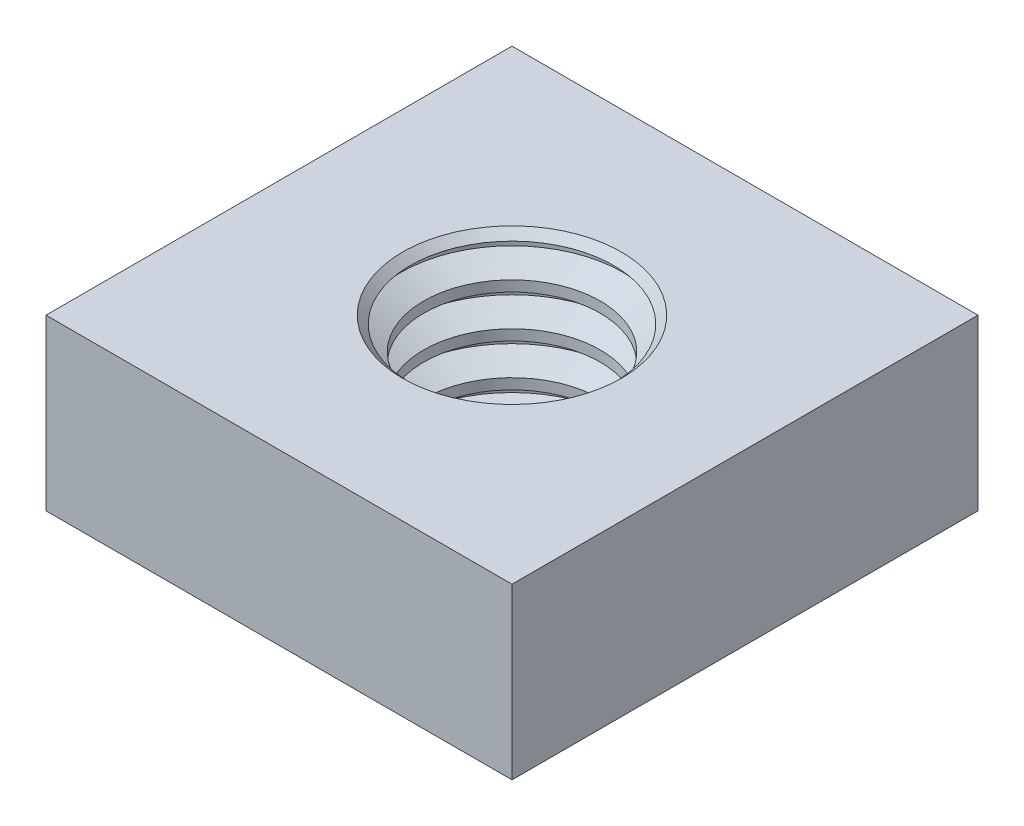
ISO-10303-21;
HEADER;
FILE_DESCRIPTION(('STEP AP214'),'2;1');
FILE_NAME('part.step','',(''),(''),'','','');
FILE_SCHEMA(('AUTOMOTIVE_DESIGN { 1 0 10303 214 1 1 1 1 }'));
ENDSEC;
DATA;
#1=APPLICATION_CONTEXT('core data for automotive mechanical design processes');
#2=APPLICATION_PROTOCOL_DEFINITION('international standard','automotive_design',2000,#1);
#3=PRODUCT_CONTEXT('',#1,'mechanical');
#4=PRODUCT('Part','Part','',(#3));
#5=PRODUCT_RELATED_PRODUCT_CATEGORY('part','',(#4));
#6=PRODUCT_DEFINITION_FORMATION('','',#4);
#7=PRODUCT_DEFINITION_CONTEXT('part definition',#1,'design');
#8=PRODUCT_DEFINITION('design','',#6,#7);
#9=PRODUCT_DEFINITION_SHAPE('','',#8);
#10=(LENGTH_UNIT() NAMED_UNIT(*) SI_UNIT(.MILLI.,.METRE.));
#11=(NAMED_UNIT(*) PLANE_ANGLE_UNIT() SI_UNIT($,.RADIAN.));
#12=(NAMED_UNIT(*) SI_UNIT($,.STERADIAN.) SOLID_ANGLE_UNIT());
#13=UNCERTAINTY_MEASURE_WITH_UNIT(LENGTH_MEASURE(1.E-05),#10,'distance_accuracy_value','');
#14=(GEOMETRIC_REPRESENTATION_CONTEXT(3) GLOBAL_UNCERTAINTY_ASSIGNED_CONTEXT((#13)) GLOBAL_UNIT_ASSIGNED_CONTEXT((#10,
#11,#12)) REPRESENTATION_CONTEXT('',''));
#15=CARTESIAN_POINT('',(0.,0.,0.));
#16=DIRECTION('',(0.,0.,1.));
#17=DIRECTION('',(1.,0.,0.));
#18=AXIS2_PLACEMENT_3D('',#15,#16,#17);
#19=CARTESIAN_POINT('',(4.365625,0.,-4.36562499999993));
#20=DIRECTION('',(0.,1.,0.));
#21=DIRECTION('',(0.,0.,1.));
#22=AXIS2_PLACEMENT_3D('',#19,#20,#21);
#23=PLANE('',#22);
#24=DIRECTION('',(-1.,0.,0.));
#25=VECTOR('',#24,1.);
#26=CARTESIAN_POINT('',(-4.365625,0.,-4.36562499999993));
#27=LINE('',#26,#25);
#28=CARTESIAN_POINT('',(4.365625,0.,-4.36562499999993));
#29=VERTEX_POINT('',#28);
#30=CARTESIAN_POINT('',(-4.365625,0.,-4.36562499999993));
#31=VERTEX_POINT('',#30);
#32=EDGE_CURVE('E100',#29,#31,#27,.T.);
#33=ORIENTED_EDGE('',*,*,#32,.F.);
#34=DIRECTION('',(0.,0.,-1.));
#35=VECTOR('',#34,1.);
#36=CARTESIAN_POINT('',(4.365625,0.,4.36562500000007));
#37=LINE('',#36,#35);
#38=CARTESIAN_POINT('',(4.365625,0.,4.36562500000007));
#39=VERTEX_POINT('',#38);
#40=EDGE_CURVE('E72',#39,#29,#37,.T.);
#41=ORIENTED_EDGE('',*,*,#40,.F.);
#42=DIRECTION('',(1.,0.,0.));
#43=VECTOR('',#42,1.);
#44=CARTESIAN_POINT('',(-4.365625,0.,4.36562500000007));
#45=LINE('',#44,#43);
#46=CARTESIAN_POINT('',(-4.365625,0.,4.36562500000007));
#47=VERTEX_POINT('',#46);
#48=EDGE_CURVE('E66',#47,#39,#45,.T.);
#49=ORIENTED_EDGE('',*,*,#48,.F.);
#50=DIRECTION('',(0.,0.,1.));
#51=VECTOR('',#50,1.);
#52=CARTESIAN_POINT('',(-4.365625,0.,-4.36562499999993));
#53=LINE('',#52,#51);
#54=EDGE_CURVE('E90',#31,#47,#53,.T.);
#55=ORIENTED_EDGE('',*,*,#54,.F.);
#56=EDGE_LOOP('',(#33,#41,#49,#55));
#57=FACE_BOUND('',#56,.T.);
#58=CARTESIAN_POINT('',(0.,0.,0.));
#59=DIRECTION('',(0.,1.,0.));
#60=DIRECTION('',(0.,0.,1.));
#61=AXIS2_PLACEMENT_3D('',#58,#59,#60);
#62=CIRCLE('',#61,1.65317020984131);
#63=CARTESIAN_POINT('',(0.,0.,1.65317020984131));
#64=VERTEX_POINT('',#63);
#65=EDGE_CURVE('E193',#64,#64,#62,.T.);
#66=ORIENTED_EDGE('',*,*,#65,.T.);
#67=EDGE_LOOP('',(#66));
#68=FACE_BOUND('',#67,.T.);
#69=ADVANCED_FACE('F32',(#57,#68),#23,.F.);
#70=CARTESIAN_POINT('',(4.365625,3.175,-4.36562499999993));
#71=DIRECTION('',(0.,1.,0.));
#72=DIRECTION('',(0.,0.,1.));
#73=AXIS2_PLACEMENT_3D('',#70,#71,#72);
#74=PLANE('',#73);
#75=CARTESIAN_POINT('',(0.,3.175,0.));
#76=DIRECTION('',(0.,1.,0.));
#77=DIRECTION('',(0.,0.,1.));
#78=AXIS2_PLACEMENT_3D('',#75,#76,#77);
#79=CIRCLE('',#78,2.05004520984131);
#80=CARTESIAN_POINT('',(0.,3.175,2.05004520984131));
#81=VERTEX_POINT('',#80);
#82=EDGE_CURVE('E11',#81,#81,#79,.F.);
#83=ORIENTED_EDGE('',*,*,#82,.T.);
#84=EDGE_LOOP('',(#83));
#85=FACE_BOUND('',#84,.T.);
#86=DIRECTION('',(-1.,0.,0.));
#87=VECTOR('',#86,1.);
#88=CARTESIAN_POINT('',(-4.365625,3.175,-4.36562499999993));
#89=LINE('',#88,#87);
#90=CARTESIAN_POINT('',(4.365625,3.175,-4.36562499999993));
#91=VERTEX_POINT('',#90);
#92=CARTESIAN_POINT('',(-4.365625,3.175,-4.36562499999993));
#93=VERTEX_POINT('',#92);
#94=EDGE_CURVE('E85',#91,#93,#89,.T.);
#95=ORIENTED_EDGE('',*,*,#94,.T.);
#96=DIRECTION('',(0.,0.,1.));
#97=VECTOR('',#96,1.);
#98=CARTESIAN_POINT('',(-4.365625,3.175,-4.36562499999993));
#99=LINE('',#98,#97);
#100=CARTESIAN_POINT('',(-4.365625,3.175,4.36562500000007));
#101=VERTEX_POINT('',#100);
#102=EDGE_CURVE('E80',#93,#101,#99,.T.);
#103=ORIENTED_EDGE('',*,*,#102,.T.);
#104=DIRECTION('',(1.,0.,0.));
#105=VECTOR('',#104,1.);
#106=CARTESIAN_POINT('',(-4.365625,3.175,4.36562500000007));
#107=LINE('',#106,#105);
#108=CARTESIAN_POINT('',(4.365625,3.175,4.36562500000007));
#109=VERTEX_POINT('',#108);
#110=EDGE_CURVE('E83',#101,#109,#107,.T.);
#111=ORIENTED_EDGE('',*,*,#110,.T.);
#112=DIRECTION('',(0.,0.,-1.));
#113=VECTOR('',#112,1.);
#114=CARTESIAN_POINT('',(4.365625,3.175,4.36562500000007));
#115=LINE('',#114,#113);
#116=EDGE_CURVE('E49',#109,#91,#115,.T.);
#117=ORIENTED_EDGE('',*,*,#116,.T.);
#118=EDGE_LOOP('',(#95,#103,#111,#117));
#119=FACE_BOUND('',#118,.T.);
#120=ADVANCED_FACE('F81',(#85,#119),#74,.T.);
#121=CARTESIAN_POINT('',(-4.365625,3.175,-4.36562499999993));
#122=DIRECTION('',(0.,0.,1.));
#123=DIRECTION('',(1.,0.,0.));
#124=AXIS2_PLACEMENT_3D('',#121,#122,#123);
#125=PLANE('',#124);
#126=ORIENTED_EDGE('',*,*,#32,.T.);
#127=DIRECTION('',(0.,-1.,0.));
#128=VECTOR('',#127,1.);
#129=CARTESIAN_POINT('',(-4.365625,3.175,-4.36562499999993));
#130=LINE('',#129,#128);
#131=EDGE_CURVE('E91',#93,#31,#130,.T.);
#132=ORIENTED_EDGE('',*,*,#131,.F.);
#133=ORIENTED_EDGE('',*,*,#94,.F.);
#134=DIRECTION('',(0.,-1.,0.));
#135=VECTOR('',#134,1.);
#136=CARTESIAN_POINT('',(4.365625,3.175,-4.36562499999993));
#137=LINE('',#136,#135);
#138=EDGE_CURVE('E96',#91,#29,#137,.T.);
#139=ORIENTED_EDGE('',*,*,#138,.T.);
#140=EDGE_LOOP('',(#126,#132,#133,#139));
#141=FACE_BOUND('',#140,.T.);
#142=ADVANCED_FACE('F131',(#141),#125,.F.);
#143=CARTESIAN_POINT('',(-4.365625,3.175,-4.36562499999993));
#144=DIRECTION('',(1.,0.,0.));
#145=DIRECTION('',(0.,0.,-1.));
#146=AXIS2_PLACEMENT_3D('',#143,#144,#145);
#147=PLANE('',#146);
#148=ORIENTED_EDGE('',*,*,#54,.T.);
#149=DIRECTION('',(0.,-1.,0.));
#150=VECTOR('',#149,1.);
#151=CARTESIAN_POINT('',(-4.365625,3.175,4.36562500000007));
#152=LINE('',#151,#150);
#153=EDGE_CURVE('E88',#101,#47,#152,.T.);
#154=ORIENTED_EDGE('',*,*,#153,.F.);
#155=ORIENTED_EDGE('',*,*,#102,.F.);
#156=ORIENTED_EDGE('',*,*,#131,.T.);
#157=EDGE_LOOP('',(#148,#154,#155,#156));
#158=FACE_BOUND('',#157,.T.);
#159=ADVANCED_FACE('F89',(#158),#147,.F.);
#160=CARTESIAN_POINT('',(-4.365625,3.175,4.36562500000007));
#161=DIRECTION('',(0.,0.,-1.));
#162=DIRECTION('',(-1.,0.,0.));
#163=AXIS2_PLACEMENT_3D('',#160,#161,#162);
#164=PLANE('',#163);
#165=ORIENTED_EDGE('',*,*,#48,.T.);
#166=DIRECTION('',(0.,-1.,0.));
#167=VECTOR('',#166,1.);
#168=CARTESIAN_POINT('',(4.365625,3.175,4.36562500000007));
#169=LINE('',#168,#167);
#170=EDGE_CURVE('E92',#109,#39,#169,.T.);
#171=ORIENTED_EDGE('',*,*,#170,.F.);
#172=ORIENTED_EDGE('',*,*,#110,.F.);
#173=ORIENTED_EDGE('',*,*,#153,.T.);
#174=EDGE_LOOP('',(#165,#171,#172,#173));
#175=FACE_BOUND('',#174,.T.);
#176=ADVANCED_FACE('F94',(#175),#164,.F.);
#177=CARTESIAN_POINT('',(4.365625,3.175,4.36562500000007));
#178=DIRECTION('',(-1.,0.,0.));
#179=DIRECTION('',(0.,0.,1.));
#180=AXIS2_PLACEMENT_3D('',#177,#178,#179);
#181=PLANE('',#180);
#182=ORIENTED_EDGE('',*,*,#40,.T.);
#183=ORIENTED_EDGE('',*,*,#138,.F.);
#184=ORIENTED_EDGE('',*,*,#116,.F.);
#185=ORIENTED_EDGE('',*,*,#170,.T.);
#186=EDGE_LOOP('',(#182,#183,#184,#185));
#187=FACE_BOUND('',#186,.T.);
#188=ADVANCED_FACE('F138',(#187),#181,.F.);
#189=CARTESIAN_POINT('',(0.,2.926953125,0.));
#190=DIRECTION('',(0.,-1.,0.));
#191=DIRECTION('',(0.,0.,-1.));
#192=AXIS2_PLACEMENT_3D('',#189,#190,#191);
#193=CONICAL_SURFACE('',#192,2.0828,1.0471975511966);
#194=CARTESIAN_POINT('',(0.,3.02973366787305,0.));
#195=DIRECTION('',(0.,1.,0.));
#196=DIRECTION('',(0.,0.,1.));
#197=AXIS2_PLACEMENT_3D('',#194,#195,#196);
#198=CIRCLE('',#197,1.90477887771436);
#199=CARTESIAN_POINT('',(0.,3.02973366787305,1.90477887771436));
#200=VERTEX_POINT('',#199);
#201=EDGE_CURVE('E41',#200,#200,#198,.T.);
#202=ORIENTED_EDGE('',*,*,#201,.T.);
#203=EDGE_LOOP('',(#202));
#204=FACE_BOUND('',#203,.T.);
#205=CARTESIAN_POINT('',(0.,2.926953125,0.));
#206=DIRECTION('',(0.,1.,0.));
#207=DIRECTION('',(0.,0.,1.));
#208=AXIS2_PLACEMENT_3D('',#205,#206,#207);
#209=CIRCLE('',#208,2.0828);
#210=CARTESIAN_POINT('',(0.,2.926953125,2.0828));
#211=VERTEX_POINT('',#210);
#212=EDGE_CURVE('E103',#211,#211,#209,.T.);
#213=ORIENTED_EDGE('',*,*,#212,.F.);
#214=EDGE_LOOP('',(#213));
#215=FACE_BOUND('',#214,.T.);
#216=ADVANCED_FACE('F112',(#204,#215),#193,.F.);
#217=CARTESIAN_POINT('',(0.,1.66357854098429,0.));
#218=DIRECTION('',(0.,1.,0.));
#219=DIRECTION('',(0.,0.,1.));
#220=AXIS2_PLACEMENT_3D('',#217,#218,#219);
#221=CYLINDRICAL_SURFACE('',#220,2.0828);
#222=ORIENTED_EDGE('',*,*,#212,.T.);
#223=EDGE_LOOP('',(#222));
#224=FACE_BOUND('',#223,.T.);
#225=CARTESIAN_POINT('',(0.,2.827734375,0.));
#226=DIRECTION('',(0.,1.,0.));
#227=DIRECTION('',(0.,0.,1.));
#228=AXIS2_PLACEMENT_3D('',#225,#226,#227);
#229=CIRCLE('',#228,2.0828);
#230=CARTESIAN_POINT('',(0.,2.827734375,2.0828));
#231=VERTEX_POINT('',#230);
#232=EDGE_CURVE('E151',#231,#231,#229,.T.);
#233=ORIENTED_EDGE('',*,*,#232,.F.);
#234=EDGE_LOOP('',(#233));
#235=FACE_BOUND('',#234,.T.);
#236=ADVANCED_FACE('F252',(#224,#235),#221,.F.);
#237=CARTESIAN_POINT('',(0.,2.5796875,0.));
#238=DIRECTION('',(0.,1.,0.));
#239=DIRECTION('',(0.,0.,1.));
#240=AXIS2_PLACEMENT_3D('',#237,#238,#239);
#241=CONICAL_SURFACE('',#240,1.65317020984131,1.0471975511966);
#242=ORIENTED_EDGE('',*,*,#232,.T.);
#243=EDGE_LOOP('',(#242));
#244=FACE_BOUND('',#243,.T.);
#245=CARTESIAN_POINT('',(0.,2.5796875,0.));
#246=DIRECTION('',(0.,1.,0.));
#247=DIRECTION('',(0.,0.,1.));
#248=AXIS2_PLACEMENT_3D('',#245,#246,#247);
#249=CIRCLE('',#248,1.65317020984131);
#250=CARTESIAN_POINT('',(0.,2.5796875,1.65317020984131));
#251=VERTEX_POINT('',#250);
#252=EDGE_CURVE('E154',#251,#251,#249,.T.);
#253=ORIENTED_EDGE('',*,*,#252,.F.);
#254=EDGE_LOOP('',(#253));
#255=FACE_BOUND('',#254,.T.);
#256=ADVANCED_FACE('F248',(#244,#255),#241,.F.);
#257=CARTESIAN_POINT('',(0.,1.66357854098429,0.));
#258=DIRECTION('',(0.,1.,0.));
#259=DIRECTION('',(0.,0.,1.));
#260=AXIS2_PLACEMENT_3D('',#257,#258,#259);
#261=CYLINDRICAL_SURFACE('',#260,1.65317020984131);
#262=ORIENTED_EDGE('',*,*,#252,.T.);
#263=EDGE_LOOP('',(#262));
#264=FACE_BOUND('',#263,.T.);
#265=CARTESIAN_POINT('',(0.,2.38125,0.));
#266=DIRECTION('',(0.,1.,0.));
#267=DIRECTION('',(0.,0.,1.));
#268=AXIS2_PLACEMENT_3D('',#265,#266,#267);
#269=CIRCLE('',#268,1.65317020984131);
#270=CARTESIAN_POINT('',(0.,2.38125,1.65317020984131));
#271=VERTEX_POINT('',#270);
#272=EDGE_CURVE('E157',#271,#271,#269,.T.);
#273=ORIENTED_EDGE('',*,*,#272,.F.);
#274=EDGE_LOOP('',(#273));
#275=FACE_BOUND('',#274,.T.);
#276=ADVANCED_FACE('F244',(#264,#275),#261,.F.);
#277=CARTESIAN_POINT('',(0.,2.133203125,0.));
#278=DIRECTION('',(0.,-1.,0.));
#279=DIRECTION('',(0.,0.,-1.));
#280=AXIS2_PLACEMENT_3D('',#277,#278,#279);
#281=CONICAL_SURFACE('',#280,2.0828,1.0471975511966);
#282=ORIENTED_EDGE('',*,*,#272,.T.);
#283=EDGE_LOOP('',(#282));
#284=FACE_BOUND('',#283,.T.);
#285=CARTESIAN_POINT('',(0.,2.133203125,0.));
#286=DIRECTION('',(0.,1.,0.));
#287=DIRECTION('',(0.,0.,1.));
#288=AXIS2_PLACEMENT_3D('',#285,#286,#287);
#289=CIRCLE('',#288,2.0828);
#290=CARTESIAN_POINT('',(0.,2.133203125,2.0828));
#291=VERTEX_POINT('',#290);
#292=EDGE_CURVE('E160',#291,#291,#289,.T.);
#293=ORIENTED_EDGE('',*,*,#292,.F.);
#294=EDGE_LOOP('',(#293));
#295=FACE_BOUND('',#294,.T.);
#296=ADVANCED_FACE('F240',(#284,#295),#281,.F.);
#297=CARTESIAN_POINT('',(0.,0.869828540984293,0.));
#298=DIRECTION('',(0.,1.,0.));
#299=DIRECTION('',(0.,0.,1.));
#300=AXIS2_PLACEMENT_3D('',#297,#298,#299);
#301=CYLINDRICAL_SURFACE('',#300,2.0828);
#302=ORIENTED_EDGE('',*,*,#292,.T.);
#303=EDGE_LOOP('',(#302));
#304=FACE_BOUND('',#303,.T.);
#305=CARTESIAN_POINT('',(0.,2.033984375,0.));
#306=DIRECTION('',(0.,1.,0.));
#307=DIRECTION('',(0.,0.,1.));
#308=AXIS2_PLACEMENT_3D('',#305,#306,#307);
#309=CIRCLE('',#308,2.0828);
#310=CARTESIAN_POINT('',(0.,2.033984375,2.0828));
#311=VERTEX_POINT('',#310);
#312=EDGE_CURVE('E163',#311,#311,#309,.T.);
#313=ORIENTED_EDGE('',*,*,#312,.F.);
#314=EDGE_LOOP('',(#313));
#315=FACE_BOUND('',#314,.T.);
#316=ADVANCED_FACE('F236',(#304,#315),#301,.F.);
#317=CARTESIAN_POINT('',(0.,1.7859375,0.));
#318=DIRECTION('',(0.,1.,0.));
#319=DIRECTION('',(0.,0.,1.));
#320=AXIS2_PLACEMENT_3D('',#317,#318,#319);
#321=CONICAL_SURFACE('',#320,1.65317020984131,1.0471975511966);
#322=ORIENTED_EDGE('',*,*,#312,.T.);
#323=EDGE_LOOP('',(#322));
#324=FACE_BOUND('',#323,.T.);
#325=CARTESIAN_POINT('',(0.,1.7859375,0.));
#326=DIRECTION('',(0.,1.,0.));
#327=DIRECTION('',(0.,0.,1.));
#328=AXIS2_PLACEMENT_3D('',#325,#326,#327);
#329=CIRCLE('',#328,1.65317020984131);
#330=CARTESIAN_POINT('',(0.,1.7859375,1.65317020984131));
#331=VERTEX_POINT('',#330);
#332=EDGE_CURVE('E166',#331,#331,#329,.T.);
#333=ORIENTED_EDGE('',*,*,#332,.F.);
#334=EDGE_LOOP('',(#333));
#335=FACE_BOUND('',#334,.T.);
#336=ADVANCED_FACE('F232',(#324,#335),#321,.F.);
#337=CARTESIAN_POINT('',(0.,0.869828540984293,0.));
#338=DIRECTION('',(0.,1.,0.));
#339=DIRECTION('',(0.,0.,1.));
#340=AXIS2_PLACEMENT_3D('',#337,#338,#339);
#341=CYLINDRICAL_SURFACE('',#340,1.65317020984131);
#342=ORIENTED_EDGE('',*,*,#332,.T.);
#343=EDGE_LOOP('',(#342));
#344=FACE_BOUND('',#343,.T.);
#345=CARTESIAN_POINT('',(0.,1.5875,0.));
#346=DIRECTION('',(0.,1.,0.));
#347=DIRECTION('',(0.,0.,1.));
#348=AXIS2_PLACEMENT_3D('',#345,#346,#347);
#349=CIRCLE('',#348,1.65317020984131);
#350=CARTESIAN_POINT('',(0.,1.5875,1.65317020984131));
#351=VERTEX_POINT('',#350);
#352=EDGE_CURVE('E169',#351,#351,#349,.T.);
#353=ORIENTED_EDGE('',*,*,#352,.F.);
#354=EDGE_LOOP('',(#353));
#355=FACE_BOUND('',#354,.T.);
#356=ADVANCED_FACE('F228',(#344,#355),#341,.F.);
#357=CARTESIAN_POINT('',(0.,1.339453125,0.));
#358=DIRECTION('',(0.,-1.,0.));
#359=DIRECTION('',(0.,0.,-1.));
#360=AXIS2_PLACEMENT_3D('',#357,#358,#359);
#361=CONICAL_SURFACE('',#360,2.0828,1.0471975511966);
#362=ORIENTED_EDGE('',*,*,#352,.T.);
#363=EDGE_LOOP('',(#362));
#364=FACE_BOUND('',#363,.T.);
#365=CARTESIAN_POINT('',(0.,1.339453125,0.));
#366=DIRECTION('',(0.,1.,0.));
#367=DIRECTION('',(0.,0.,1.));
#368=AXIS2_PLACEMENT_3D('',#365,#366,#367);
#369=CIRCLE('',#368,2.0828);
#370=CARTESIAN_POINT('',(0.,1.339453125,2.0828));
#371=VERTEX_POINT('',#370);
#372=EDGE_CURVE('E172',#371,#371,#369,.T.);
#373=ORIENTED_EDGE('',*,*,#372,.F.);
#374=EDGE_LOOP('',(#373));
#375=FACE_BOUND('',#374,.T.);
#376=ADVANCED_FACE('F224',(#364,#375),#361,.F.);
#377=CARTESIAN_POINT('',(0.,0.0760785409842932,0.));
#378=DIRECTION('',(0.,1.,0.));
#379=DIRECTION('',(0.,0.,1.));
#380=AXIS2_PLACEMENT_3D('',#377,#378,#379);
#381=CYLINDRICAL_SURFACE('',#380,2.0828);
#382=ORIENTED_EDGE('',*,*,#372,.T.);
#383=EDGE_LOOP('',(#382));
#384=FACE_BOUND('',#383,.T.);
#385=CARTESIAN_POINT('',(0.,1.240234375,0.));
#386=DIRECTION('',(0.,1.,0.));
#387=DIRECTION('',(0.,0.,1.));
#388=AXIS2_PLACEMENT_3D('',#385,#386,#387);
#389=CIRCLE('',#388,2.0828);
#390=CARTESIAN_POINT('',(0.,1.240234375,2.0828));
#391=VERTEX_POINT('',#390);
#392=EDGE_CURVE('E175',#391,#391,#389,.T.);
#393=ORIENTED_EDGE('',*,*,#392,.F.);
#394=EDGE_LOOP('',(#393));
#395=FACE_BOUND('',#394,.T.);
#396=ADVANCED_FACE('F220',(#384,#395),#381,.F.);
#397=CARTESIAN_POINT('',(0.,0.992187499999999,0.));
#398=DIRECTION('',(0.,1.,0.));
#399=DIRECTION('',(0.,0.,1.));
#400=AXIS2_PLACEMENT_3D('',#397,#398,#399);
#401=CONICAL_SURFACE('',#400,1.65317020984131,1.0471975511966);
#402=ORIENTED_EDGE('',*,*,#392,.T.);
#403=EDGE_LOOP('',(#402));
#404=FACE_BOUND('',#403,.T.);
#405=CARTESIAN_POINT('',(0.,0.992187499999999,0.));
#406=DIRECTION('',(0.,1.,0.));
#407=DIRECTION('',(0.,0.,1.));
#408=AXIS2_PLACEMENT_3D('',#405,#406,#407);
#409=CIRCLE('',#408,1.65317020984131);
#410=CARTESIAN_POINT('',(0.,0.992187499999999,1.65317020984131));
#411=VERTEX_POINT('',#410);
#412=EDGE_CURVE('E178',#411,#411,#409,.T.);
#413=ORIENTED_EDGE('',*,*,#412,.F.);
#414=EDGE_LOOP('',(#413));
#415=FACE_BOUND('',#414,.T.);
#416=ADVANCED_FACE('F216',(#404,#415),#401,.F.);
#417=CARTESIAN_POINT('',(0.,0.0760785409842932,0.));
#418=DIRECTION('',(0.,1.,0.));
#419=DIRECTION('',(0.,0.,1.));
#420=AXIS2_PLACEMENT_3D('',#417,#418,#419);
#421=CYLINDRICAL_SURFACE('',#420,1.65317020984131);
#422=ORIENTED_EDGE('',*,*,#412,.T.);
#423=EDGE_LOOP('',(#422));
#424=FACE_BOUND('',#423,.T.);
#425=CARTESIAN_POINT('',(0.,0.79375,0.));
#426=DIRECTION('',(0.,1.,0.));
#427=DIRECTION('',(0.,0.,1.));
#428=AXIS2_PLACEMENT_3D('',#425,#426,#427);
#429=CIRCLE('',#428,1.65317020984131);
#430=CARTESIAN_POINT('',(0.,0.79375,1.65317020984131));
#431=VERTEX_POINT('',#430);
#432=EDGE_CURVE('E181',#431,#431,#429,.T.);
#433=ORIENTED_EDGE('',*,*,#432,.F.);
#434=EDGE_LOOP('',(#433));
#435=FACE_BOUND('',#434,.T.);
#436=ADVANCED_FACE('F212',(#424,#435),#421,.F.);
#437=CARTESIAN_POINT('',(0.,0.545703125,0.));
#438=DIRECTION('',(0.,-1.,0.));
#439=DIRECTION('',(0.,0.,-1.));
#440=AXIS2_PLACEMENT_3D('',#437,#438,#439);
#441=CONICAL_SURFACE('',#440,2.0828,1.0471975511966);
#442=ORIENTED_EDGE('',*,*,#432,.T.);
#443=EDGE_LOOP('',(#442));
#444=FACE_BOUND('',#443,.T.);
#445=CARTESIAN_POINT('',(0.,0.545703125,0.));
#446=DIRECTION('',(0.,1.,0.));
#447=DIRECTION('',(0.,0.,1.));
#448=AXIS2_PLACEMENT_3D('',#445,#446,#447);
#449=CIRCLE('',#448,2.0828);
#450=CARTESIAN_POINT('',(0.,0.545703125,2.0828));
#451=VERTEX_POINT('',#450);
#452=EDGE_CURVE('E184',#451,#451,#449,.T.);
#453=ORIENTED_EDGE('',*,*,#452,.F.);
#454=EDGE_LOOP('',(#453));
#455=FACE_BOUND('',#454,.T.);
#456=ADVANCED_FACE('F206',(#444,#455),#441,.F.);
#457=CARTESIAN_POINT('',(0.,-0.717671459015707,0.));
#458=DIRECTION('',(0.,1.,0.));
#459=DIRECTION('',(0.,0.,1.));
#460=AXIS2_PLACEMENT_3D('',#457,#458,#459);
#461=CYLINDRICAL_SURFACE('',#460,2.0828);
#462=ORIENTED_EDGE('',*,*,#452,.T.);
#463=EDGE_LOOP('',(#462));
#464=FACE_BOUND('',#463,.T.);
#465=CARTESIAN_POINT('',(0.,0.446484375,0.));
#466=DIRECTION('',(0.,1.,0.));
#467=DIRECTION('',(0.,0.,1.));
#468=AXIS2_PLACEMENT_3D('',#465,#466,#467);
#469=CIRCLE('',#468,2.0828);
#470=CARTESIAN_POINT('',(0.,0.446484375,2.0828));
#471=VERTEX_POINT('',#470);
#472=EDGE_CURVE('E187',#471,#471,#469,.T.);
#473=ORIENTED_EDGE('',*,*,#472,.F.);
#474=EDGE_LOOP('',(#473));
#475=FACE_BOUND('',#474,.T.);
#476=ADVANCED_FACE('F200',(#464,#475),#461,.F.);
#477=CARTESIAN_POINT('',(0.,0.198437499999999,0.));
#478=DIRECTION('',(0.,1.,0.));
#479=DIRECTION('',(0.,0.,1.));
#480=AXIS2_PLACEMENT_3D('',#477,#478,#479);
#481=CONICAL_SURFACE('',#480,1.65317020984131,1.0471975511966);
#482=ORIENTED_EDGE('',*,*,#472,.T.);
#483=EDGE_LOOP('',(#482));
#484=FACE_BOUND('',#483,.T.);
#485=CARTESIAN_POINT('',(0.,0.198437499999999,0.));
#486=DIRECTION('',(0.,1.,0.));
#487=DIRECTION('',(0.,0.,1.));
#488=AXIS2_PLACEMENT_3D('',#485,#486,#487);
#489=CIRCLE('',#488,1.65317020984131);
#490=CARTESIAN_POINT('',(0.,0.198437499999999,1.65317020984131));
#491=VERTEX_POINT('',#490);
#492=EDGE_CURVE('E190',#491,#491,#489,.T.);
#493=ORIENTED_EDGE('',*,*,#492,.F.);
#494=EDGE_LOOP('',(#493));
#495=FACE_BOUND('',#494,.T.);
#496=ADVANCED_FACE('F121',(#484,#495),#481,.F.);
#497=CARTESIAN_POINT('',(0.,-0.717671459015707,0.));
#498=DIRECTION('',(0.,1.,0.));
#499=DIRECTION('',(0.,0.,1.));
#500=AXIS2_PLACEMENT_3D('',#497,#498,#499);
#501=CYLINDRICAL_SURFACE('',#500,1.65317020984131);
#502=ORIENTED_EDGE('',*,*,#492,.T.);
#503=EDGE_LOOP('',(#502));
#504=FACE_BOUND('',#503,.T.);
#505=ORIENTED_EDGE('',*,*,#65,.F.);
#506=EDGE_LOOP('',(#505));
#507=FACE_BOUND('',#506,.T.);
#508=ADVANCED_FACE('F116',(#504,#507),#501,.F.);
#509=CARTESIAN_POINT('',(0.,3.02973366787305,0.));
#510=DIRECTION('',(0.,1.,0.));
#511=DIRECTION('',(0.,0.,1.));
#512=AXIS2_PLACEMENT_3D('',#509,#510,#511);
#513=CONICAL_SURFACE('',#512,1.90477887771436,0.78539816339745);
#514=ORIENTED_EDGE('',*,*,#82,.F.);
#515=EDGE_LOOP('',(#514));
#516=FACE_BOUND('',#515,.T.);
#517=ORIENTED_EDGE('',*,*,#201,.F.);
#518=EDGE_LOOP('',(#517));
#519=FACE_BOUND('',#518,.T.);
#520=ADVANCED_FACE('F34',(#516,#519),#513,.F.);
#521=CLOSED_SHELL('',(#69,#120,#142,#159,#176,#188,#216,#236,#256,#276,#296,#316,#336,#356,#376,
#396,#416,#436,#456,#476,#496,#508,#520));
#522=MANIFOLD_SOLID_BREP('B2',#521);
#523=ADVANCED_BREP_SHAPE_REPRESENTATION('',(#18,#522),#14);
#524=SHAPE_DEFINITION_REPRESENTATION(#9,#523);
ENDSEC;
END-ISO-10303-21;
